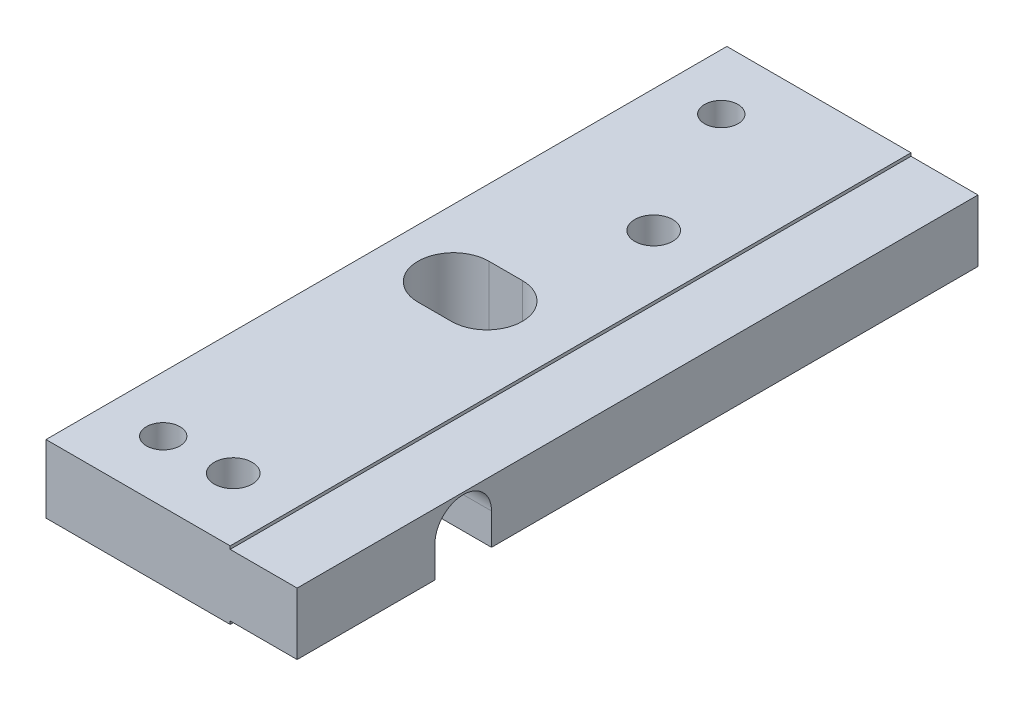
ISO-10303-21;
HEADER;
FILE_DESCRIPTION(('STEP AP214'),'2;1');
FILE_NAME('part.step','',(''),(''),'','','');
FILE_SCHEMA(('AUTOMOTIVE_DESIGN { 1 0 10303 214 1 1 1 1 }'));
ENDSEC;
DATA;
#1=APPLICATION_CONTEXT('core data for automotive mechanical design processes');
#2=APPLICATION_PROTOCOL_DEFINITION('international standard','automotive_design',2000,#1);
#3=PRODUCT_CONTEXT('',#1,'mechanical');
#4=PRODUCT('Part','Part','',(#3));
#5=PRODUCT_RELATED_PRODUCT_CATEGORY('part','',(#4));
#6=PRODUCT_DEFINITION_FORMATION('','',#4);
#7=PRODUCT_DEFINITION_CONTEXT('part definition',#1,'design');
#8=PRODUCT_DEFINITION('design','',#6,#7);
#9=PRODUCT_DEFINITION_SHAPE('','',#8);
#10=(LENGTH_UNIT() NAMED_UNIT(*) SI_UNIT(.MILLI.,.METRE.));
#11=(NAMED_UNIT(*) PLANE_ANGLE_UNIT() SI_UNIT($,.RADIAN.));
#12=(NAMED_UNIT(*) SI_UNIT($,.STERADIAN.) SOLID_ANGLE_UNIT());
#13=UNCERTAINTY_MEASURE_WITH_UNIT(LENGTH_MEASURE(1.E-05),#10,'distance_accuracy_value','');
#14=(GEOMETRIC_REPRESENTATION_CONTEXT(3) GLOBAL_UNCERTAINTY_ASSIGNED_CONTEXT((#13)) GLOBAL_UNIT_ASSIGNED_CONTEXT((#10,
#11,#12)) REPRESENTATION_CONTEXT('',''));
#15=CARTESIAN_POINT('',(0.,0.,0.));
#16=DIRECTION('',(0.,0.,1.));
#17=DIRECTION('',(1.,0.,0.));
#18=AXIS2_PLACEMENT_3D('',#15,#16,#17);
#19=CARTESIAN_POINT('',(22.5,-3.05,0.));
#20=DIRECTION('',(0.,1.,0.));
#21=DIRECTION('',(0.,0.,1.));
#22=AXIS2_PLACEMENT_3D('',#19,#20,#21);
#23=PLANE('',#22);
#24=CARTESIAN_POINT('',(11.,-3.05,-5.772));
#25=DIRECTION('',(0.,-1.,0.));
#26=DIRECTION('',(0.,0.,-1.));
#27=AXIS2_PLACEMENT_3D('',#24,#25,#26);
#28=CIRCLE('',#27,3.25);
#29=CARTESIAN_POINT('',(11.,-3.05,-9.022));
#30=VERTEX_POINT('',#29);
#31=EDGE_CURVE('E404',#30,#30,#28,.T.);
#32=ORIENTED_EDGE('',*,*,#31,.F.);
#33=EDGE_LOOP('',(#32));
#34=FACE_BOUND('',#33,.T.);
#35=CARTESIAN_POINT('',(5.00000000000001,-3.05,-5.5));
#36=DIRECTION('',(0.,1.,0.));
#37=DIRECTION('',(0.,0.,1.));
#38=AXIS2_PLACEMENT_3D('',#35,#36,#37);
#39=CIRCLE('',#38,1.5);
#40=CARTESIAN_POINT('',(5.00000000000001,-3.05,-4.));
#41=VERTEX_POINT('',#40);
#42=EDGE_CURVE('E378',#41,#41,#39,.T.);
#43=ORIENTED_EDGE('',*,*,#42,.T.);
#44=EDGE_LOOP('',(#43));
#45=FACE_BOUND('',#44,.T.);
#46=DIRECTION('',(0.,0.,-1.));
#47=VECTOR('',#46,1.);
#48=CARTESIAN_POINT('',(0.,-3.05,0.));
#49=LINE('',#48,#47);
#50=CARTESIAN_POINT('',(0.,-3.05,0.));
#51=VERTEX_POINT('',#50);
#52=CARTESIAN_POINT('',(0.,-3.05,-12.3486));
#53=VERTEX_POINT('',#52);
#54=EDGE_CURVE('E277',#51,#53,#49,.T.);
#55=ORIENTED_EDGE('',*,*,#54,.T.);
#56=DIRECTION('',(-1.,0.,0.));
#57=VECTOR('',#56,1.);
#58=CARTESIAN_POINT('',(22.5,-3.05,-12.3486));
#59=LINE('',#58,#57);
#60=CARTESIAN_POINT('',(16.5,-3.05,-12.3486));
#61=VERTEX_POINT('',#60);
#62=EDGE_CURVE('E221',#61,#53,#59,.T.);
#63=ORIENTED_EDGE('',*,*,#62,.F.);
#64=DIRECTION('',(0.,0.,-1.));
#65=VECTOR('',#64,1.);
#66=CARTESIAN_POINT('',(16.5,-3.05,0.));
#67=LINE('',#66,#65);
#68=CARTESIAN_POINT('',(16.5,-3.05,0.));
#69=VERTEX_POINT('',#68);
#70=EDGE_CURVE('E261',#69,#61,#67,.T.);
#71=ORIENTED_EDGE('',*,*,#70,.F.);
#72=DIRECTION('',(-1.,0.,0.));
#73=VECTOR('',#72,1.);
#74=CARTESIAN_POINT('',(22.5,-3.05,0.));
#75=LINE('',#74,#73);
#76=EDGE_CURVE('E291',#69,#51,#75,.T.);
#77=ORIENTED_EDGE('',*,*,#76,.T.);
#78=EDGE_LOOP('',(#55,#63,#71,#77));
#79=FACE_BOUND('',#78,.T.);
#80=ADVANCED_FACE('F36',(#34,#45,#79),#23,.F.);
#81=CARTESIAN_POINT('',(16.5,-2.775,0.));
#82=DIRECTION('',(0.,-1.,0.));
#83=DIRECTION('',(0.,0.,-1.));
#84=AXIS2_PLACEMENT_3D('',#81,#82,#83);
#85=PLANE('',#84);
#86=DIRECTION('',(-1.,0.,0.));
#87=VECTOR('',#86,1.);
#88=CARTESIAN_POINT('',(16.5,-2.775,-12.3486));
#89=LINE('',#88,#87);
#90=CARTESIAN_POINT('',(22.5,-2.775,-12.3486));
#91=VERTEX_POINT('',#90);
#92=CARTESIAN_POINT('',(16.5,-2.775,-12.3486));
#93=VERTEX_POINT('',#92);
#94=EDGE_CURVE('E228',#91,#93,#89,.T.);
#95=ORIENTED_EDGE('',*,*,#94,.F.);
#96=DIRECTION('',(0.,0.,-1.));
#97=VECTOR('',#96,1.);
#98=CARTESIAN_POINT('',(22.5,-2.775,0.));
#99=LINE('',#98,#97);
#100=CARTESIAN_POINT('',(22.5,-2.775,0.));
#101=VERTEX_POINT('',#100);
#102=EDGE_CURVE('E239',#101,#91,#99,.T.);
#103=ORIENTED_EDGE('',*,*,#102,.F.);
#104=DIRECTION('',(1.,0.,0.));
#105=VECTOR('',#104,1.);
#106=CARTESIAN_POINT('',(16.5,-2.775,0.));
#107=LINE('',#106,#105);
#108=CARTESIAN_POINT('',(16.5,-2.775,0.));
#109=VERTEX_POINT('',#108);
#110=EDGE_CURVE('E238',#109,#101,#107,.T.);
#111=ORIENTED_EDGE('',*,*,#110,.F.);
#112=DIRECTION('',(0.,0.,-1.));
#113=VECTOR('',#112,1.);
#114=CARTESIAN_POINT('',(16.5,-2.775,0.));
#115=LINE('',#114,#113);
#116=EDGE_CURVE('E231',#109,#93,#115,.T.);
#117=ORIENTED_EDGE('',*,*,#116,.T.);
#118=EDGE_LOOP('',(#95,#103,#111,#117));
#119=FACE_BOUND('',#118,.T.);
#120=ADVANCED_FACE('F355',(#119),#85,.T.);
#121=CARTESIAN_POINT('',(16.5,0.,-30.5));
#122=DIRECTION('',(1.,0.,0.));
#123=DIRECTION('',(0.,0.,-1.));
#124=AXIS2_PLACEMENT_3D('',#121,#122,#123);
#125=PLANE('',#124);
#126=DIRECTION('',(0.,-1.,0.));
#127=VECTOR('',#126,1.);
#128=CARTESIAN_POINT('',(16.5,0.,-12.3486));
#129=LINE('',#128,#127);
#130=EDGE_CURVE('E12',#93,#61,#129,.T.);
#131=ORIENTED_EDGE('',*,*,#130,.F.);
#132=ORIENTED_EDGE('',*,*,#116,.F.);
#133=DIRECTION('',(0.,-1.,0.));
#134=VECTOR('',#133,1.);
#135=CARTESIAN_POINT('',(16.5,-3.05,0.));
#136=LINE('',#135,#134);
#137=EDGE_CURVE('E260',#109,#69,#136,.T.);
#138=ORIENTED_EDGE('',*,*,#137,.T.);
#139=ORIENTED_EDGE('',*,*,#70,.T.);
#140=EDGE_LOOP('',(#131,#132,#138,#139));
#141=FACE_BOUND('',#140,.T.);
#142=ADVANCED_FACE('F352',(#141),#125,.T.);
#143=CARTESIAN_POINT('',(22.5,-3.05,0.));
#144=DIRECTION('',(0.,0.,-1.));
#145=DIRECTION('',(-1.,0.,0.));
#146=AXIS2_PLACEMENT_3D('',#143,#144,#145);
#147=PLANE('',#146);
#148=DIRECTION('',(1.,0.,0.));
#149=VECTOR('',#148,1.);
#150=CARTESIAN_POINT('',(16.5,2.775,0.));
#151=LINE('',#150,#149);
#152=CARTESIAN_POINT('',(16.5,2.775,0.));
#153=VERTEX_POINT('',#152);
#154=CARTESIAN_POINT('',(22.5,2.775,0.));
#155=VERTEX_POINT('',#154);
#156=EDGE_CURVE('E245',#153,#155,#151,.T.);
#157=ORIENTED_EDGE('',*,*,#156,.F.);
#158=CARTESIAN_POINT('',(16.5,3.05,0.));
#159=VERTEX_POINT('',#158);
#160=EDGE_CURVE('E257',#159,#153,#136,.T.);
#161=ORIENTED_EDGE('',*,*,#160,.F.);
#162=DIRECTION('',(-1.,0.,0.));
#163=VECTOR('',#162,1.);
#164=CARTESIAN_POINT('',(22.5,3.05,0.));
#165=LINE('',#164,#163);
#166=CARTESIAN_POINT('',(0.,3.05,0.));
#167=VERTEX_POINT('',#166);
#168=EDGE_CURVE('E272',#159,#167,#165,.T.);
#169=ORIENTED_EDGE('',*,*,#168,.T.);
#170=DIRECTION('',(0.,-1.,0.));
#171=VECTOR('',#170,1.);
#172=CARTESIAN_POINT('',(0.,-3.05,0.));
#173=LINE('',#172,#171);
#174=EDGE_CURVE('E273',#167,#51,#173,.T.);
#175=ORIENTED_EDGE('',*,*,#174,.T.);
#176=ORIENTED_EDGE('',*,*,#76,.F.);
#177=ORIENTED_EDGE('',*,*,#137,.F.);
#178=ORIENTED_EDGE('',*,*,#110,.T.);
#179=DIRECTION('',(0.,-1.,0.));
#180=VECTOR('',#179,1.);
#181=CARTESIAN_POINT('',(22.5,-3.05,0.));
#182=LINE('',#181,#180);
#183=EDGE_CURVE('E265',#155,#101,#182,.T.);
#184=ORIENTED_EDGE('',*,*,#183,.F.);
#185=EDGE_LOOP('',(#157,#161,#169,#175,#176,#177,#178,#184));
#186=FACE_BOUND('',#185,.T.);
#187=ADVANCED_FACE('F38',(#186),#147,.F.);
#188=CARTESIAN_POINT('',(11.,-3.05,-43.447));
#189=DIRECTION('',(0.,-1.,0.));
#190=DIRECTION('',(0.,0.,-1.));
#191=AXIS2_PLACEMENT_3D('',#188,#189,#190);
#192=CIRCLE('',#191,3.25);
#193=CARTESIAN_POINT('',(11.,-3.05,-46.697));
#194=VERTEX_POINT('',#193);
#195=EDGE_CURVE('E373',#194,#194,#192,.T.);
#196=ORIENTED_EDGE('',*,*,#195,.F.);
#197=EDGE_LOOP('',(#196));
#198=FACE_BOUND('',#197,.T.);
#199=CARTESIAN_POINT('',(5.,-3.05,-55.5));
#200=DIRECTION('',(0.,1.,0.));
#201=DIRECTION('',(0.,0.,1.));
#202=AXIS2_PLACEMENT_3D('',#199,#200,#201);
#203=CIRCLE('',#202,1.5);
#204=CARTESIAN_POINT('',(5.,-3.05,-54.));
#205=VERTEX_POINT('',#204);
#206=EDGE_CURVE('E191',#205,#205,#203,.T.);
#207=ORIENTED_EDGE('',*,*,#206,.T.);
#208=EDGE_LOOP('',(#207));
#209=FACE_BOUND('',#208,.T.);
#210=DIRECTION('',(1.,0.,0.));
#211=VECTOR('',#210,1.);
#212=CARTESIAN_POINT('',(9.00000000000001,-3.05,-27.325));
#213=LINE('',#212,#211);
#214=CARTESIAN_POINT('',(6.,-3.05,-27.325));
#215=VERTEX_POINT('',#214);
#216=CARTESIAN_POINT('',(9.00000000000001,-3.05,-27.325));
#217=VERTEX_POINT('',#216);
#218=EDGE_CURVE('E168',#215,#217,#213,.T.);
#219=ORIENTED_EDGE('',*,*,#218,.T.);
#220=CARTESIAN_POINT('',(9.00000000000001,-3.05,-30.5));
#221=DIRECTION('',(0.,1.,0.));
#222=DIRECTION('',(0.,0.,1.));
#223=AXIS2_PLACEMENT_3D('',#220,#221,#222);
#224=CIRCLE('',#223,3.175);
#225=CARTESIAN_POINT('',(9.00000000000001,-3.05,-33.675));
#226=VERTEX_POINT('',#225);
#227=EDGE_CURVE('E162',#217,#226,#224,.T.);
#228=ORIENTED_EDGE('',*,*,#227,.T.);
#229=DIRECTION('',(-1.,0.,0.));
#230=VECTOR('',#229,1.);
#231=CARTESIAN_POINT('',(9.00000000000001,-3.05,-33.675));
#232=LINE('',#231,#230);
#233=CARTESIAN_POINT('',(6.00000000000001,-3.05,-33.675));
#234=VERTEX_POINT('',#233);
#235=EDGE_CURVE('E171',#226,#234,#232,.T.);
#236=ORIENTED_EDGE('',*,*,#235,.T.);
#237=CARTESIAN_POINT('',(6.,-3.05,-30.5));
#238=DIRECTION('',(0.,1.,0.));
#239=DIRECTION('',(0.,0.,1.));
#240=AXIS2_PLACEMENT_3D('',#237,#238,#239);
#241=CIRCLE('',#240,3.175);
#242=EDGE_CURVE('E51',#234,#215,#241,.T.);
#243=ORIENTED_EDGE('',*,*,#242,.T.);
#244=EDGE_LOOP('',(#219,#228,#236,#243));
#245=FACE_BOUND('',#244,.T.);
#246=CARTESIAN_POINT('',(16.5,-3.05,-17.4134));
#247=VERTEX_POINT('',#246);
#248=CARTESIAN_POINT('',(16.5,-3.05,-61.));
#249=VERTEX_POINT('',#248);
#250=EDGE_CURVE('E264',#247,#249,#67,.T.);
#251=ORIENTED_EDGE('',*,*,#250,.F.);
#252=DIRECTION('',(-1.,0.,0.));
#253=VECTOR('',#252,1.);
#254=CARTESIAN_POINT('',(22.5,-3.05,-17.4134));
#255=LINE('',#254,#253);
#256=CARTESIAN_POINT('',(0.,-3.05,-17.4134));
#257=VERTEX_POINT('',#256);
#258=EDGE_CURVE('E223',#247,#257,#255,.T.);
#259=ORIENTED_EDGE('',*,*,#258,.T.);
#260=CARTESIAN_POINT('',(0.,-3.05,-61.));
#261=VERTEX_POINT('',#260);
#262=EDGE_CURVE('E276',#257,#261,#49,.T.);
#263=ORIENTED_EDGE('',*,*,#262,.T.);
#264=DIRECTION('',(-1.,0.,0.));
#265=VECTOR('',#264,1.);
#266=CARTESIAN_POINT('',(22.5,-3.05,-61.));
#267=LINE('',#266,#265);
#268=EDGE_CURVE('E288',#249,#261,#267,.T.);
#269=ORIENTED_EDGE('',*,*,#268,.F.);
#270=EDGE_LOOP('',(#251,#259,#263,#269));
#271=FACE_BOUND('',#270,.T.);
#272=ADVANCED_FACE('F175',(#198,#209,#245,#271),#23,.F.);
#273=CARTESIAN_POINT('',(22.5,-3.05,-61.));
#274=DIRECTION('',(0.,0.,1.));
#275=DIRECTION('',(1.,0.,0.));
#276=AXIS2_PLACEMENT_3D('',#273,#274,#275);
#277=PLANE('',#276);
#278=DIRECTION('',(1.,0.,0.));
#279=VECTOR('',#278,1.);
#280=CARTESIAN_POINT('',(16.5,2.775,-61.));
#281=LINE('',#280,#279);
#282=CARTESIAN_POINT('',(16.5,2.775,-61.));
#283=VERTEX_POINT('',#282);
#284=CARTESIAN_POINT('',(22.5,2.775,-61.));
#285=VERTEX_POINT('',#284);
#286=EDGE_CURVE('E248',#283,#285,#281,.T.);
#287=ORIENTED_EDGE('',*,*,#286,.T.);
#288=DIRECTION('',(0.,1.,0.));
#289=VECTOR('',#288,1.);
#290=CARTESIAN_POINT('',(22.5,-3.05,-61.));
#291=LINE('',#290,#289);
#292=CARTESIAN_POINT('',(22.5,-2.775,-61.));
#293=VERTEX_POINT('',#292);
#294=EDGE_CURVE('E268',#293,#285,#291,.T.);
#295=ORIENTED_EDGE('',*,*,#294,.F.);
#296=DIRECTION('',(1.,0.,0.));
#297=VECTOR('',#296,1.);
#298=CARTESIAN_POINT('',(16.5,-2.775,-61.));
#299=LINE('',#298,#297);
#300=CARTESIAN_POINT('',(16.5,-2.775,-61.));
#301=VERTEX_POINT('',#300);
#302=EDGE_CURVE('E251',#301,#293,#299,.T.);
#303=ORIENTED_EDGE('',*,*,#302,.F.);
#304=DIRECTION('',(0.,1.,0.));
#305=VECTOR('',#304,1.);
#306=CARTESIAN_POINT('',(16.5,-3.05,-61.));
#307=LINE('',#306,#305);
#308=EDGE_CURVE('E258',#249,#301,#307,.T.);
#309=ORIENTED_EDGE('',*,*,#308,.F.);
#310=ORIENTED_EDGE('',*,*,#268,.T.);
#311=DIRECTION('',(0.,1.,0.));
#312=VECTOR('',#311,1.);
#313=CARTESIAN_POINT('',(0.,-3.05,-61.));
#314=LINE('',#313,#312);
#315=CARTESIAN_POINT('',(0.,3.05,-61.));
#316=VERTEX_POINT('',#315);
#317=EDGE_CURVE('E280',#261,#316,#314,.T.);
#318=ORIENTED_EDGE('',*,*,#317,.T.);
#319=DIRECTION('',(-1.,0.,0.));
#320=VECTOR('',#319,1.);
#321=CARTESIAN_POINT('',(22.5,3.05,-61.));
#322=LINE('',#321,#320);
#323=CARTESIAN_POINT('',(16.5,3.05,-61.));
#324=VERTEX_POINT('',#323);
#325=EDGE_CURVE('E286',#324,#316,#322,.T.);
#326=ORIENTED_EDGE('',*,*,#325,.F.);
#327=EDGE_CURVE('E247',#283,#324,#307,.T.);
#328=ORIENTED_EDGE('',*,*,#327,.F.);
#329=EDGE_LOOP('',(#287,#295,#303,#309,#310,#318,#326,#328));
#330=FACE_BOUND('',#329,.T.);
#331=ADVANCED_FACE('F312',(#330),#277,.F.);
#332=CARTESIAN_POINT('',(22.5,3.05,0.));
#333=DIRECTION('',(0.,-1.,0.));
#334=DIRECTION('',(0.,0.,-1.));
#335=AXIS2_PLACEMENT_3D('',#332,#333,#334);
#336=PLANE('',#335);
#337=CARTESIAN_POINT('',(11.,3.05,-5.772));
#338=DIRECTION('',(0.,-1.,0.));
#339=DIRECTION('',(0.,0.,-1.));
#340=AXIS2_PLACEMENT_3D('',#337,#338,#339);
#341=CIRCLE('',#340,1.7);
#342=CARTESIAN_POINT('',(11.,3.05,-7.472));
#343=VERTEX_POINT('',#342);
#344=EDGE_CURVE('E395',#343,#343,#341,.T.);
#345=ORIENTED_EDGE('',*,*,#344,.T.);
#346=EDGE_LOOP('',(#345));
#347=FACE_BOUND('',#346,.T.);
#348=CARTESIAN_POINT('',(11.,3.05,-43.447));
#349=DIRECTION('',(0.,-1.,0.));
#350=DIRECTION('',(0.,0.,-1.));
#351=AXIS2_PLACEMENT_3D('',#348,#349,#350);
#352=CIRCLE('',#351,1.7);
#353=CARTESIAN_POINT('',(11.,3.05,-45.147));
#354=VERTEX_POINT('',#353);
#355=EDGE_CURVE('E383',#354,#354,#352,.T.);
#356=ORIENTED_EDGE('',*,*,#355,.T.);
#357=EDGE_LOOP('',(#356));
#358=FACE_BOUND('',#357,.T.);
#359=CARTESIAN_POINT('',(5.00000000000001,3.05,-5.5));
#360=DIRECTION('',(0.,1.,0.));
#361=DIRECTION('',(0.,0.,1.));
#362=AXIS2_PLACEMENT_3D('',#359,#360,#361);
#363=CIRCLE('',#362,1.5);
#364=CARTESIAN_POINT('',(5.00000000000001,3.05,-4.));
#365=VERTEX_POINT('',#364);
#366=EDGE_CURVE('E380',#365,#365,#363,.T.);
#367=ORIENTED_EDGE('',*,*,#366,.F.);
#368=EDGE_LOOP('',(#367));
#369=FACE_BOUND('',#368,.T.);
#370=CARTESIAN_POINT('',(5.,3.05,-55.5));
#371=DIRECTION('',(0.,1.,0.));
#372=DIRECTION('',(0.,0.,1.));
#373=AXIS2_PLACEMENT_3D('',#370,#371,#372);
#374=CIRCLE('',#373,1.5);
#375=CARTESIAN_POINT('',(5.,3.05,-54.));
#376=VERTEX_POINT('',#375);
#377=EDGE_CURVE('E184',#376,#376,#374,.T.);
#378=ORIENTED_EDGE('',*,*,#377,.F.);
#379=EDGE_LOOP('',(#378));
#380=FACE_BOUND('',#379,.T.);
#381=DIRECTION('',(-1.,0.,0.));
#382=VECTOR('',#381,1.);
#383=CARTESIAN_POINT('',(9.00000000000001,3.05,-33.675));
#384=LINE('',#383,#382);
#385=CARTESIAN_POINT('',(9.00000000000001,3.05,-33.675));
#386=VERTEX_POINT('',#385);
#387=CARTESIAN_POINT('',(6.,3.05,-33.675));
#388=VERTEX_POINT('',#387);
#389=EDGE_CURVE('E190',#386,#388,#384,.T.);
#390=ORIENTED_EDGE('',*,*,#389,.F.);
#391=CARTESIAN_POINT('',(9.00000000000001,3.05,-30.5));
#392=DIRECTION('',(0.,1.,0.));
#393=DIRECTION('',(0.,0.,1.));
#394=AXIS2_PLACEMENT_3D('',#391,#392,#393);
#395=CIRCLE('',#394,3.175);
#396=CARTESIAN_POINT('',(9.00000000000001,3.05,-27.325));
#397=VERTEX_POINT('',#396);
#398=EDGE_CURVE('E59',#397,#386,#395,.T.);
#399=ORIENTED_EDGE('',*,*,#398,.F.);
#400=DIRECTION('',(1.,0.,0.));
#401=VECTOR('',#400,1.);
#402=CARTESIAN_POINT('',(9.00000000000001,3.05,-27.325));
#403=LINE('',#402,#401);
#404=CARTESIAN_POINT('',(6.,3.05,-27.325));
#405=VERTEX_POINT('',#404);
#406=EDGE_CURVE('E178',#405,#397,#403,.T.);
#407=ORIENTED_EDGE('',*,*,#406,.F.);
#408=CARTESIAN_POINT('',(6.,3.05,-30.5));
#409=DIRECTION('',(0.,1.,0.));
#410=DIRECTION('',(0.,0.,1.));
#411=AXIS2_PLACEMENT_3D('',#408,#409,#410);
#412=CIRCLE('',#411,3.175);
#413=EDGE_CURVE('E181',#388,#405,#412,.T.);
#414=ORIENTED_EDGE('',*,*,#413,.F.);
#415=EDGE_LOOP('',(#390,#399,#407,#414));
#416=FACE_BOUND('',#415,.T.);
#417=DIRECTION('',(0.,0.,1.));
#418=VECTOR('',#417,1.);
#419=CARTESIAN_POINT('',(16.5,3.05,0.));
#420=LINE('',#419,#418);
#421=EDGE_CURVE('E293',#324,#159,#420,.T.);
#422=ORIENTED_EDGE('',*,*,#421,.F.);
#423=ORIENTED_EDGE('',*,*,#325,.T.);
#424=DIRECTION('',(0.,0.,1.));
#425=VECTOR('',#424,1.);
#426=CARTESIAN_POINT('',(0.,3.05,0.));
#427=LINE('',#426,#425);
#428=EDGE_CURVE('E269',#316,#167,#427,.T.);
#429=ORIENTED_EDGE('',*,*,#428,.T.);
#430=ORIENTED_EDGE('',*,*,#168,.F.);
#431=EDGE_LOOP('',(#422,#423,#429,#430));
#432=FACE_BOUND('',#431,.T.);
#433=ADVANCED_FACE('F334',(#347,#358,#369,#380,#416,#432),#336,.F.);
#434=CARTESIAN_POINT('',(22.5,3.05,0.));
#435=DIRECTION('',(-1.,0.,0.));
#436=DIRECTION('',(0.,0.,1.));
#437=AXIS2_PLACEMENT_3D('',#434,#435,#436);
#438=PLANE('',#437);
#439=ORIENTED_EDGE('',*,*,#102,.T.);
#440=DIRECTION('',(0.,1.,0.));
#441=VECTOR('',#440,1.);
#442=CARTESIAN_POINT('',(22.5,0.0496000000000007,-12.3486));
#443=LINE('',#442,#441);
#444=CARTESIAN_POINT('',(22.5,0.0496000000000007,-12.3486));
#445=VERTEX_POINT('',#444);
#446=EDGE_CURVE('E208',#91,#445,#443,.T.);
#447=ORIENTED_EDGE('',*,*,#446,.T.);
#448=CARTESIAN_POINT('',(22.5,0.0496000000000003,-14.881));
#449=DIRECTION('',(-1.,0.,0.));
#450=DIRECTION('',(0.,0.,1.));
#451=AXIS2_PLACEMENT_3D('',#448,#449,#450);
#452=CIRCLE('',#451,2.5324);
#453=CARTESIAN_POINT('',(22.5,0.0496000000000003,-17.4134));
#454=VERTEX_POINT('',#453);
#455=EDGE_CURVE('E201',#445,#454,#452,.T.);
#456=ORIENTED_EDGE('',*,*,#455,.T.);
#457=DIRECTION('',(0.,-1.,0.));
#458=VECTOR('',#457,1.);
#459=CARTESIAN_POINT('',(22.5,-3.05,-17.4134));
#460=LINE('',#459,#458);
#461=CARTESIAN_POINT('',(22.5,-2.775,-17.4134));
#462=VERTEX_POINT('',#461);
#463=EDGE_CURVE('E204',#454,#462,#460,.T.);
#464=ORIENTED_EDGE('',*,*,#463,.T.);
#465=EDGE_CURVE('E230',#462,#293,#99,.T.);
#466=ORIENTED_EDGE('',*,*,#465,.T.);
#467=ORIENTED_EDGE('',*,*,#294,.T.);
#468=DIRECTION('',(0.,0.,1.));
#469=VECTOR('',#468,1.);
#470=CARTESIAN_POINT('',(22.5,2.775,0.));
#471=LINE('',#470,#469);
#472=EDGE_CURVE('E242',#285,#155,#471,.T.);
#473=ORIENTED_EDGE('',*,*,#472,.T.);
#474=ORIENTED_EDGE('',*,*,#183,.T.);
#475=EDGE_LOOP('',(#439,#447,#456,#464,#466,#467,#473,#474));
#476=FACE_BOUND('',#475,.T.);
#477=ADVANCED_FACE('F315',(#476),#438,.F.);
#478=CARTESIAN_POINT('',(0.,3.05,0.));
#479=DIRECTION('',(-1.,0.,0.));
#480=DIRECTION('',(0.,0.,1.));
#481=AXIS2_PLACEMENT_3D('',#478,#479,#480);
#482=PLANE('',#481);
#483=DIRECTION('',(0.,1.,0.));
#484=VECTOR('',#483,1.);
#485=CARTESIAN_POINT('',(0.,0.0496000000000007,-12.3486));
#486=LINE('',#485,#484);
#487=CARTESIAN_POINT('',(0.,0.0496000000000007,-12.3486));
#488=VERTEX_POINT('',#487);
#489=EDGE_CURVE('E205',#53,#488,#486,.T.);
#490=ORIENTED_EDGE('',*,*,#489,.F.);
#491=ORIENTED_EDGE('',*,*,#54,.F.);
#492=ORIENTED_EDGE('',*,*,#174,.F.);
#493=ORIENTED_EDGE('',*,*,#428,.F.);
#494=ORIENTED_EDGE('',*,*,#317,.F.);
#495=ORIENTED_EDGE('',*,*,#262,.F.);
#496=DIRECTION('',(0.,-1.,0.));
#497=VECTOR('',#496,1.);
#498=CARTESIAN_POINT('',(0.,-3.05,-17.4134));
#499=LINE('',#498,#497);
#500=CARTESIAN_POINT('',(0.,0.0496000000000003,-17.4134));
#501=VERTEX_POINT('',#500);
#502=EDGE_CURVE('E214',#501,#257,#499,.T.);
#503=ORIENTED_EDGE('',*,*,#502,.F.);
#504=CARTESIAN_POINT('',(0.,0.0496000000000003,-14.881));
#505=DIRECTION('',(-1.,0.,0.));
#506=DIRECTION('',(0.,0.,1.));
#507=AXIS2_PLACEMENT_3D('',#504,#505,#506);
#508=CIRCLE('',#507,2.5324);
#509=EDGE_CURVE('E197',#488,#501,#508,.T.);
#510=ORIENTED_EDGE('',*,*,#509,.F.);
#511=EDGE_LOOP('',(#490,#491,#492,#493,#494,#495,#503,#510));
#512=FACE_BOUND('',#511,.T.);
#513=ADVANCED_FACE('F325',(#512),#482,.T.);
#514=DIRECTION('',(1.,0.,0.));
#515=VECTOR('',#514,1.);
#516=CARTESIAN_POINT('',(16.5,-2.775,-17.4134));
#517=LINE('',#516,#515);
#518=CARTESIAN_POINT('',(16.5,-2.775,-17.4134));
#519=VERTEX_POINT('',#518);
#520=EDGE_CURVE('E220',#519,#462,#517,.T.);
#521=ORIENTED_EDGE('',*,*,#520,.F.);
#522=EDGE_CURVE('E235',#519,#301,#115,.T.);
#523=ORIENTED_EDGE('',*,*,#522,.T.);
#524=ORIENTED_EDGE('',*,*,#302,.T.);
#525=ORIENTED_EDGE('',*,*,#465,.F.);
#526=EDGE_LOOP('',(#521,#523,#524,#525));
#527=FACE_BOUND('',#526,.T.);
#528=ADVANCED_FACE('F304',(#527),#85,.T.);
#529=DIRECTION('',(0.,1.,0.));
#530=VECTOR('',#529,1.);
#531=CARTESIAN_POINT('',(16.5,0.,-17.4134));
#532=LINE('',#531,#530);
#533=EDGE_CURVE('E44',#247,#519,#532,.T.);
#534=ORIENTED_EDGE('',*,*,#533,.F.);
#535=ORIENTED_EDGE('',*,*,#250,.T.);
#536=ORIENTED_EDGE('',*,*,#308,.T.);
#537=ORIENTED_EDGE('',*,*,#522,.F.);
#538=EDGE_LOOP('',(#534,#535,#536,#537));
#539=FACE_BOUND('',#538,.T.);
#540=ADVANCED_FACE('F306',(#539),#125,.T.);
#541=ORIENTED_EDGE('',*,*,#160,.T.);
#542=DIRECTION('',(0.,0.,1.));
#543=VECTOR('',#542,1.);
#544=CARTESIAN_POINT('',(16.5,2.775,0.));
#545=LINE('',#544,#543);
#546=EDGE_CURVE('E234',#283,#153,#545,.T.);
#547=ORIENTED_EDGE('',*,*,#546,.F.);
#548=ORIENTED_EDGE('',*,*,#327,.T.);
#549=ORIENTED_EDGE('',*,*,#421,.T.);
#550=EDGE_LOOP('',(#541,#547,#548,#549));
#551=FACE_BOUND('',#550,.T.);
#552=ADVANCED_FACE('F337',(#551),#125,.T.);
#553=CARTESIAN_POINT('',(16.5,2.775,0.));
#554=DIRECTION('',(0.,1.,0.));
#555=DIRECTION('',(0.,0.,1.));
#556=AXIS2_PLACEMENT_3D('',#553,#554,#555);
#557=PLANE('',#556);
#558=ORIENTED_EDGE('',*,*,#472,.F.);
#559=ORIENTED_EDGE('',*,*,#286,.F.);
#560=ORIENTED_EDGE('',*,*,#546,.T.);
#561=ORIENTED_EDGE('',*,*,#156,.T.);
#562=EDGE_LOOP('',(#558,#559,#560,#561));
#563=FACE_BOUND('',#562,.T.);
#564=ADVANCED_FACE('F342',(#563),#557,.T.);
#565=CARTESIAN_POINT('',(22.5,0.0496000000000003,-14.881));
#566=DIRECTION('',(-1.,0.,0.));
#567=DIRECTION('',(0.,0.,1.));
#568=AXIS2_PLACEMENT_3D('',#565,#566,#567);
#569=CYLINDRICAL_SURFACE('',#568,2.5324);
#570=ORIENTED_EDGE('',*,*,#509,.T.);
#571=DIRECTION('',(-1.,0.,0.));
#572=VECTOR('',#571,1.);
#573=CARTESIAN_POINT('',(22.5,0.0496000000000003,-17.4134));
#574=LINE('',#573,#572);
#575=EDGE_CURVE('E211',#454,#501,#574,.T.);
#576=ORIENTED_EDGE('',*,*,#575,.F.);
#577=ORIENTED_EDGE('',*,*,#455,.F.);
#578=DIRECTION('',(-1.,0.,0.));
#579=VECTOR('',#578,1.);
#580=CARTESIAN_POINT('',(22.5,0.0496000000000007,-12.3486));
#581=LINE('',#580,#579);
#582=EDGE_CURVE('E218',#445,#488,#581,.T.);
#583=ORIENTED_EDGE('',*,*,#582,.T.);
#584=EDGE_LOOP('',(#570,#576,#577,#583));
#585=FACE_BOUND('',#584,.T.);
#586=ADVANCED_FACE('F321',(#585),#569,.F.);
#587=CARTESIAN_POINT('',(22.5,0.0496000000000007,-12.3486));
#588=DIRECTION('',(0.,0.,1.));
#589=DIRECTION('',(1.,0.,0.));
#590=AXIS2_PLACEMENT_3D('',#587,#588,#589);
#591=PLANE('',#590);
#592=ORIENTED_EDGE('',*,*,#94,.T.);
#593=ORIENTED_EDGE('',*,*,#130,.T.);
#594=ORIENTED_EDGE('',*,*,#62,.T.);
#595=ORIENTED_EDGE('',*,*,#489,.T.);
#596=ORIENTED_EDGE('',*,*,#582,.F.);
#597=ORIENTED_EDGE('',*,*,#446,.F.);
#598=EDGE_LOOP('',(#592,#593,#594,#595,#596,#597));
#599=FACE_BOUND('',#598,.T.);
#600=ADVANCED_FACE('F349',(#599),#591,.F.);
#601=CARTESIAN_POINT('',(22.5,-3.05,-17.4134));
#602=DIRECTION('',(0.,0.,-1.));
#603=DIRECTION('',(-1.,0.,0.));
#604=AXIS2_PLACEMENT_3D('',#601,#602,#603);
#605=PLANE('',#604);
#606=ORIENTED_EDGE('',*,*,#520,.T.);
#607=ORIENTED_EDGE('',*,*,#463,.F.);
#608=ORIENTED_EDGE('',*,*,#575,.T.);
#609=ORIENTED_EDGE('',*,*,#502,.T.);
#610=ORIENTED_EDGE('',*,*,#258,.F.);
#611=ORIENTED_EDGE('',*,*,#533,.T.);
#612=EDGE_LOOP('',(#606,#607,#608,#609,#610,#611));
#613=FACE_BOUND('',#612,.T.);
#614=ADVANCED_FACE('F297',(#613),#605,.F.);
#615=CARTESIAN_POINT('',(9.00000000000001,-3.05,-30.5));
#616=DIRECTION('',(0.,1.,0.));
#617=DIRECTION('',(0.,0.,1.));
#618=AXIS2_PLACEMENT_3D('',#615,#616,#617);
#619=CYLINDRICAL_SURFACE('',#618,3.175);
#620=ORIENTED_EDGE('',*,*,#398,.T.);
#621=DIRECTION('',(0.,1.,0.));
#622=VECTOR('',#621,1.);
#623=CARTESIAN_POINT('',(9.00000000000001,-3.05,-33.675));
#624=LINE('',#623,#622);
#625=EDGE_CURVE('E158',#226,#386,#624,.T.);
#626=ORIENTED_EDGE('',*,*,#625,.F.);
#627=ORIENTED_EDGE('',*,*,#227,.F.);
#628=DIRECTION('',(0.,1.,0.));
#629=VECTOR('',#628,1.);
#630=CARTESIAN_POINT('',(9.00000000000001,-3.05,-27.325));
#631=LINE('',#630,#629);
#632=EDGE_CURVE('E195',#217,#397,#631,.T.);
#633=ORIENTED_EDGE('',*,*,#632,.T.);
#634=EDGE_LOOP('',(#620,#626,#627,#633));
#635=FACE_BOUND('',#634,.T.);
#636=ADVANCED_FACE('F160',(#635),#619,.F.);
#637=CARTESIAN_POINT('',(9.00000000000001,-3.05,-27.325));
#638=DIRECTION('',(0.,0.,1.));
#639=DIRECTION('',(1.,0.,0.));
#640=AXIS2_PLACEMENT_3D('',#637,#638,#639);
#641=PLANE('',#640);
#642=ORIENTED_EDGE('',*,*,#406,.T.);
#643=ORIENTED_EDGE('',*,*,#632,.F.);
#644=ORIENTED_EDGE('',*,*,#218,.F.);
#645=DIRECTION('',(0.,1.,0.));
#646=VECTOR('',#645,1.);
#647=CARTESIAN_POINT('',(6.,-3.05,-27.325));
#648=LINE('',#647,#646);
#649=EDGE_CURVE('E198',#215,#405,#648,.T.);
#650=ORIENTED_EDGE('',*,*,#649,.T.);
#651=EDGE_LOOP('',(#642,#643,#644,#650));
#652=FACE_BOUND('',#651,.T.);
#653=ADVANCED_FACE('F442',(#652),#641,.F.);
#654=CARTESIAN_POINT('',(6.,-3.05,-30.5));
#655=DIRECTION('',(0.,1.,0.));
#656=DIRECTION('',(0.,0.,1.));
#657=AXIS2_PLACEMENT_3D('',#654,#655,#656);
#658=CYLINDRICAL_SURFACE('',#657,3.175);
#659=ORIENTED_EDGE('',*,*,#413,.T.);
#660=ORIENTED_EDGE('',*,*,#649,.F.);
#661=ORIENTED_EDGE('',*,*,#242,.F.);
#662=DIRECTION('',(0.,1.,0.));
#663=VECTOR('',#662,1.);
#664=CARTESIAN_POINT('',(6.,-3.05,-33.675));
#665=LINE('',#664,#663);
#666=EDGE_CURVE('E167',#234,#388,#665,.T.);
#667=ORIENTED_EDGE('',*,*,#666,.T.);
#668=EDGE_LOOP('',(#659,#660,#661,#667));
#669=FACE_BOUND('',#668,.T.);
#670=ADVANCED_FACE('F445',(#669),#658,.F.);
#671=CARTESIAN_POINT('',(9.00000000000001,-3.05,-33.675));
#672=DIRECTION('',(0.,0.,-1.));
#673=DIRECTION('',(-1.,0.,0.));
#674=AXIS2_PLACEMENT_3D('',#671,#672,#673);
#675=PLANE('',#674);
#676=ORIENTED_EDGE('',*,*,#389,.T.);
#677=ORIENTED_EDGE('',*,*,#666,.F.);
#678=ORIENTED_EDGE('',*,*,#235,.F.);
#679=ORIENTED_EDGE('',*,*,#625,.T.);
#680=EDGE_LOOP('',(#676,#677,#678,#679));
#681=FACE_BOUND('',#680,.T.);
#682=ADVANCED_FACE('F172',(#681),#675,.F.);
#683=CARTESIAN_POINT('',(5.,-3.05,-55.5));
#684=DIRECTION('',(0.,1.,0.));
#685=DIRECTION('',(0.,0.,1.));
#686=AXIS2_PLACEMENT_3D('',#683,#684,#685);
#687=CYLINDRICAL_SURFACE('',#686,1.5);
#688=ORIENTED_EDGE('',*,*,#206,.F.);
#689=EDGE_LOOP('',(#688));
#690=FACE_BOUND('',#689,.T.);
#691=ORIENTED_EDGE('',*,*,#377,.T.);
#692=EDGE_LOOP('',(#691));
#693=FACE_BOUND('',#692,.T.);
#694=ADVANCED_FACE('F438',(#690,#693),#687,.F.);
#695=CARTESIAN_POINT('',(5.00000000000001,-3.05,-5.5));
#696=DIRECTION('',(0.,1.,0.));
#697=DIRECTION('',(0.,0.,1.));
#698=AXIS2_PLACEMENT_3D('',#695,#696,#697);
#699=CYLINDRICAL_SURFACE('',#698,1.5);
#700=ORIENTED_EDGE('',*,*,#42,.F.);
#701=EDGE_LOOP('',(#700));
#702=FACE_BOUND('',#701,.T.);
#703=ORIENTED_EDGE('',*,*,#366,.T.);
#704=EDGE_LOOP('',(#703));
#705=FACE_BOUND('',#704,.T.);
#706=ADVANCED_FACE('F434',(#702,#705),#699,.F.);
#707=CARTESIAN_POINT('',(11.,-3.05,-43.447));
#708=DIRECTION('',(0.,-1.,0.));
#709=DIRECTION('',(0.,0.,-1.));
#710=AXIS2_PLACEMENT_3D('',#707,#708,#709);
#711=CYLINDRICAL_SURFACE('',#710,1.7);
#712=ORIENTED_EDGE('',*,*,#355,.F.);
#713=EDGE_LOOP('',(#712));
#714=FACE_BOUND('',#713,.T.);
#715=CARTESIAN_POINT('',(11.,-0.850000000000001,-43.447));
#716=DIRECTION('',(0.,-1.,0.));
#717=DIRECTION('',(0.,0.,-1.));
#718=AXIS2_PLACEMENT_3D('',#715,#716,#717);
#719=CIRCLE('',#718,1.7);
#720=CARTESIAN_POINT('',(11.,-0.850000000000001,-45.147));
#721=VERTEX_POINT('',#720);
#722=EDGE_CURVE('E388',#721,#721,#719,.T.);
#723=ORIENTED_EDGE('',*,*,#722,.T.);
#724=EDGE_LOOP('',(#723));
#725=FACE_BOUND('',#724,.T.);
#726=ADVANCED_FACE('F430',(#714,#725),#711,.F.);
#727=CARTESIAN_POINT('',(12.7,-0.850000000000001,-43.447));
#728=DIRECTION('',(0.,1.,0.));
#729=DIRECTION('',(0.,0.,1.));
#730=AXIS2_PLACEMENT_3D('',#727,#728,#729);
#731=PLANE('',#730);
#732=ORIENTED_EDGE('',*,*,#722,.F.);
#733=EDGE_LOOP('',(#732));
#734=FACE_BOUND('',#733,.T.);
#735=CARTESIAN_POINT('',(11.,-0.850000000000001,-43.447));
#736=DIRECTION('',(0.,-1.,0.));
#737=DIRECTION('',(0.,0.,-1.));
#738=AXIS2_PLACEMENT_3D('',#735,#736,#737);
#739=CIRCLE('',#738,3.25);
#740=CARTESIAN_POINT('',(11.,-0.850000000000001,-46.697));
#741=VERTEX_POINT('',#740);
#742=EDGE_CURVE('E391',#741,#741,#739,.T.);
#743=ORIENTED_EDGE('',*,*,#742,.T.);
#744=EDGE_LOOP('',(#743));
#745=FACE_BOUND('',#744,.T.);
#746=ADVANCED_FACE('F426',(#734,#745),#731,.F.);
#747=CARTESIAN_POINT('',(11.,-3.05,-43.447));
#748=DIRECTION('',(0.,-1.,0.));
#749=DIRECTION('',(0.,0.,-1.));
#750=AXIS2_PLACEMENT_3D('',#747,#748,#749);
#751=CYLINDRICAL_SURFACE('',#750,3.25);
#752=ORIENTED_EDGE('',*,*,#742,.F.);
#753=EDGE_LOOP('',(#752));
#754=FACE_BOUND('',#753,.T.);
#755=ORIENTED_EDGE('',*,*,#195,.T.);
#756=EDGE_LOOP('',(#755));
#757=FACE_BOUND('',#756,.T.);
#758=ADVANCED_FACE('F422',(#754,#757),#751,.F.);
#759=CARTESIAN_POINT('',(11.,-3.05,-5.772));
#760=DIRECTION('',(0.,-1.,0.));
#761=DIRECTION('',(0.,0.,-1.));
#762=AXIS2_PLACEMENT_3D('',#759,#760,#761);
#763=CYLINDRICAL_SURFACE('',#762,1.7);
#764=ORIENTED_EDGE('',*,*,#344,.F.);
#765=EDGE_LOOP('',(#764));
#766=FACE_BOUND('',#765,.T.);
#767=CARTESIAN_POINT('',(11.,-0.850000000000001,-5.772));
#768=DIRECTION('',(0.,-1.,0.));
#769=DIRECTION('',(0.,0.,-1.));
#770=AXIS2_PLACEMENT_3D('',#767,#768,#769);
#771=CIRCLE('',#770,1.7);
#772=CARTESIAN_POINT('',(11.,-0.850000000000001,-7.472));
#773=VERTEX_POINT('',#772);
#774=EDGE_CURVE('E398',#773,#773,#771,.T.);
#775=ORIENTED_EDGE('',*,*,#774,.T.);
#776=EDGE_LOOP('',(#775));
#777=FACE_BOUND('',#776,.T.);
#778=ADVANCED_FACE('F415',(#766,#777),#763,.F.);
#779=CARTESIAN_POINT('',(12.7,-0.850000000000001,-5.772));
#780=DIRECTION('',(0.,1.,0.));
#781=DIRECTION('',(0.,0.,1.));
#782=AXIS2_PLACEMENT_3D('',#779,#780,#781);
#783=PLANE('',#782);
#784=ORIENTED_EDGE('',*,*,#774,.F.);
#785=EDGE_LOOP('',(#784));
#786=FACE_BOUND('',#785,.T.);
#787=CARTESIAN_POINT('',(11.,-0.850000000000001,-5.772));
#788=DIRECTION('',(0.,-1.,0.));
#789=DIRECTION('',(0.,0.,-1.));
#790=AXIS2_PLACEMENT_3D('',#787,#788,#789);
#791=CIRCLE('',#790,3.25);
#792=CARTESIAN_POINT('',(11.,-0.850000000000001,-9.022));
#793=VERTEX_POINT('',#792);
#794=EDGE_CURVE('E401',#793,#793,#791,.T.);
#795=ORIENTED_EDGE('',*,*,#794,.T.);
#796=EDGE_LOOP('',(#795));
#797=FACE_BOUND('',#796,.T.);
#798=ADVANCED_FACE('F409',(#786,#797),#783,.F.);
#799=CARTESIAN_POINT('',(11.,-3.05,-5.772));
#800=DIRECTION('',(0.,-1.,0.));
#801=DIRECTION('',(0.,0.,-1.));
#802=AXIS2_PLACEMENT_3D('',#799,#800,#801);
#803=CYLINDRICAL_SURFACE('',#802,3.25);
#804=ORIENTED_EDGE('',*,*,#794,.F.);
#805=EDGE_LOOP('',(#804));
#806=FACE_BOUND('',#805,.T.);
#807=ORIENTED_EDGE('',*,*,#31,.T.);
#808=EDGE_LOOP('',(#807));
#809=FACE_BOUND('',#808,.T.);
#810=ADVANCED_FACE('F407',(#806,#809),#803,.F.);
#811=CLOSED_SHELL('',(#80,#120,#142,#187,#272,#331,#433,#477,#513,#528,#540,#552,#564,#586,#600,
#614,#636,#653,#670,#682,#694,#706,#726,#746,#758,#778,#798,#810));
#812=MANIFOLD_SOLID_BREP('B2',#811);
#813=ADVANCED_BREP_SHAPE_REPRESENTATION('',(#18,#812),#14);
#814=SHAPE_DEFINITION_REPRESENTATION(#9,#813);
ENDSEC;
END-ISO-10303-21;
